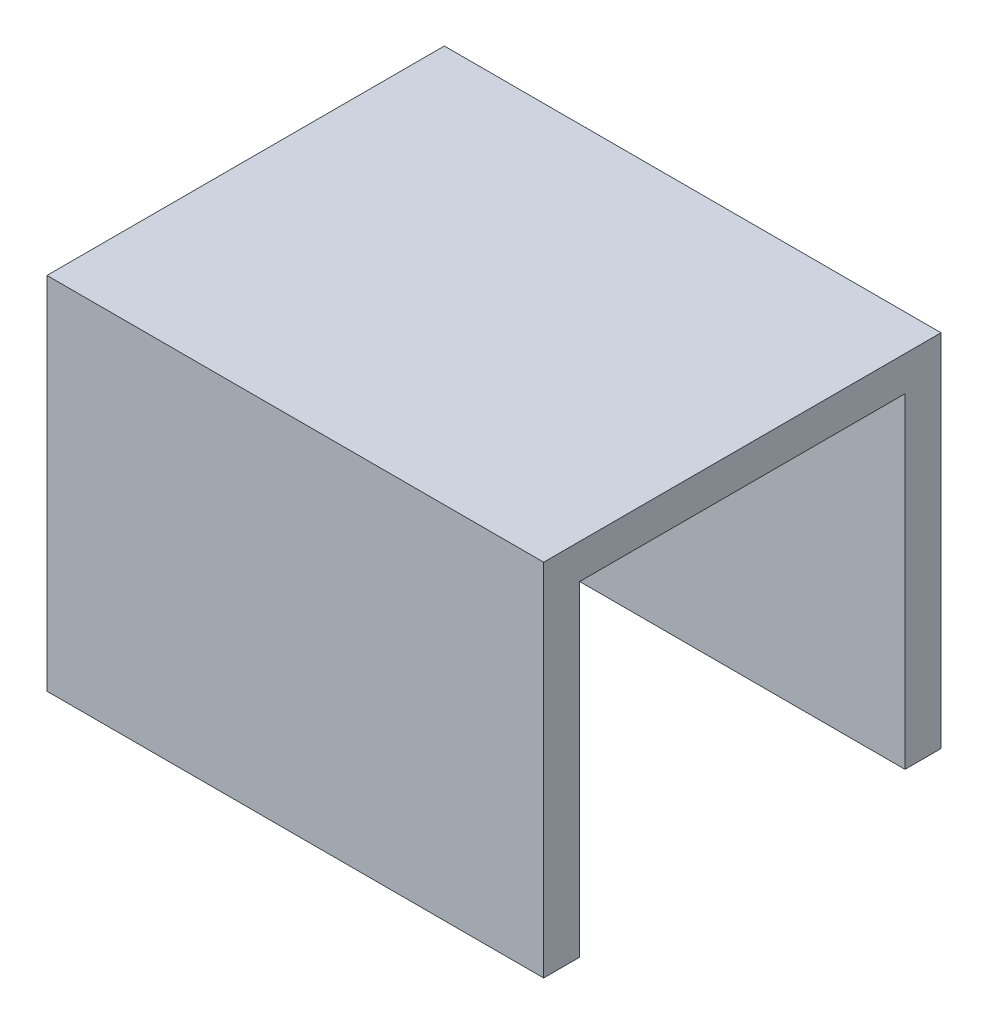
ISO-10303-21;
HEADER;
FILE_DESCRIPTION(('STEP AP214'),'2;1');
FILE_NAME('part.step','',(''),(''),'','','');
FILE_SCHEMA(('AUTOMOTIVE_DESIGN { 1 0 10303 214 1 1 1 1 }'));
ENDSEC;
DATA;
#1=APPLICATION_CONTEXT('core data for automotive mechanical design processes');
#2=APPLICATION_PROTOCOL_DEFINITION('international standard','automotive_design',2000,#1);
#3=PRODUCT_CONTEXT('',#1,'mechanical');
#4=PRODUCT('Part','Part','',(#3));
#5=PRODUCT_RELATED_PRODUCT_CATEGORY('part','',(#4));
#6=PRODUCT_DEFINITION_FORMATION('','',#4);
#7=PRODUCT_DEFINITION_CONTEXT('part definition',#1,'design');
#8=PRODUCT_DEFINITION('design','',#6,#7);
#9=PRODUCT_DEFINITION_SHAPE('','',#8);
#10=(LENGTH_UNIT() NAMED_UNIT(*) SI_UNIT(.MILLI.,.METRE.));
#11=(NAMED_UNIT(*) PLANE_ANGLE_UNIT() SI_UNIT($,.RADIAN.));
#12=(NAMED_UNIT(*) SI_UNIT($,.STERADIAN.) SOLID_ANGLE_UNIT());
#13=UNCERTAINTY_MEASURE_WITH_UNIT(LENGTH_MEASURE(1.E-05),#10,'distance_accuracy_value','');
#14=(GEOMETRIC_REPRESENTATION_CONTEXT(3) GLOBAL_UNCERTAINTY_ASSIGNED_CONTEXT((#13)) GLOBAL_UNIT_ASSIGNED_CONTEXT((#10,
#11,#12)) REPRESENTATION_CONTEXT('',''));
#15=CARTESIAN_POINT('',(0.,0.,0.));
#16=DIRECTION('',(0.,0.,1.));
#17=DIRECTION('',(1.,0.,0.));
#18=AXIS2_PLACEMENT_3D('',#15,#16,#17);
#19=CARTESIAN_POINT('',(0.,0.,0.));
#20=DIRECTION('',(0.,1.,0.));
#21=DIRECTION('',(0.,0.,1.));
#22=AXIS2_PLACEMENT_3D('',#19,#20,#21);
#23=PLANE('',#22);
#24=DIRECTION('',(0.,0.,-1.));
#25=VECTOR('',#24,1.);
#26=CARTESIAN_POINT('',(10.,0.,8.));
#27=LINE('',#26,#25);
#28=CARTESIAN_POINT('',(10.,0.,-6.55));
#29=VERTEX_POINT('',#28);
#30=CARTESIAN_POINT('',(10.,0.,-8.));
#31=VERTEX_POINT('',#30);
#32=EDGE_CURVE('E124',#29,#31,#27,.T.);
#33=ORIENTED_EDGE('',*,*,#32,.F.);
#34=DIRECTION('',(-1.,0.,0.));
#35=VECTOR('',#34,1.);
#36=CARTESIAN_POINT('',(10.001,0.,-6.55));
#37=LINE('',#36,#35);
#38=CARTESIAN_POINT('',(-10.,0.,-6.55));
#39=VERTEX_POINT('',#38);
#40=EDGE_CURVE('E107',#29,#39,#37,.T.);
#41=ORIENTED_EDGE('',*,*,#40,.T.);
#42=DIRECTION('',(0.,0.,1.));
#43=VECTOR('',#42,1.);
#44=CARTESIAN_POINT('',(-10.,0.,8.));
#45=LINE('',#44,#43);
#46=CARTESIAN_POINT('',(-10.,0.,-8.));
#47=VERTEX_POINT('',#46);
#48=EDGE_CURVE('E132',#47,#39,#45,.T.);
#49=ORIENTED_EDGE('',*,*,#48,.F.);
#50=DIRECTION('',(-1.,0.,0.));
#51=VECTOR('',#50,1.);
#52=CARTESIAN_POINT('',(10.,0.,-8.));
#53=LINE('',#52,#51);
#54=EDGE_CURVE('E78',#31,#47,#53,.T.);
#55=ORIENTED_EDGE('',*,*,#54,.F.);
#56=EDGE_LOOP('',(#33,#41,#49,#55));
#57=FACE_BOUND('',#56,.T.);
#58=ADVANCED_FACE('F33',(#57),#23,.F.);
#59=CARTESIAN_POINT('',(-10.,14.5,8.));
#60=DIRECTION('',(1.,0.,0.));
#61=DIRECTION('',(0.,0.,-1.));
#62=AXIS2_PLACEMENT_3D('',#59,#60,#61);
#63=PLANE('',#62);
#64=ORIENTED_EDGE('',*,*,#48,.T.);
#65=DIRECTION('',(0.,-1.,0.));
#66=VECTOR('',#65,1.);
#67=CARTESIAN_POINT('',(-10.,0.,-6.55));
#68=LINE('',#67,#66);
#69=CARTESIAN_POINT('',(-10.,13.1,-6.55));
#70=VERTEX_POINT('',#69);
#71=EDGE_CURVE('E113',#70,#39,#68,.T.);
#72=ORIENTED_EDGE('',*,*,#71,.F.);
#73=DIRECTION('',(0.,0.,-1.));
#74=VECTOR('',#73,1.);
#75=CARTESIAN_POINT('',(-10.,13.1,-6.55));
#76=LINE('',#75,#74);
#77=CARTESIAN_POINT('',(-10.,13.1,6.55));
#78=VERTEX_POINT('',#77);
#79=EDGE_CURVE('E119',#78,#70,#76,.T.);
#80=ORIENTED_EDGE('',*,*,#79,.F.);
#81=DIRECTION('',(0.,1.,0.));
#82=VECTOR('',#81,1.);
#83=CARTESIAN_POINT('',(-10.,0.,6.55));
#84=LINE('',#83,#82);
#85=CARTESIAN_POINT('',(-10.,0.,6.55));
#86=VERTEX_POINT('',#85);
#87=EDGE_CURVE('E166',#86,#78,#84,.T.);
#88=ORIENTED_EDGE('',*,*,#87,.F.);
#89=CARTESIAN_POINT('',(-10.,0.,8.));
#90=VERTEX_POINT('',#89);
#91=EDGE_CURVE('E149',#86,#90,#45,.T.);
#92=ORIENTED_EDGE('',*,*,#91,.T.);
#93=DIRECTION('',(0.,-1.,0.));
#94=VECTOR('',#93,1.);
#95=CARTESIAN_POINT('',(-10.,14.5,8.));
#96=LINE('',#95,#94);
#97=CARTESIAN_POINT('',(-10.,14.5,8.));
#98=VERTEX_POINT('',#97);
#99=EDGE_CURVE('E11',#98,#90,#96,.T.);
#100=ORIENTED_EDGE('',*,*,#99,.F.);
#101=DIRECTION('',(0.,0.,1.));
#102=VECTOR('',#101,1.);
#103=CARTESIAN_POINT('',(-10.,14.5,8.));
#104=LINE('',#103,#102);
#105=CARTESIAN_POINT('',(-10.,14.5,-8.));
#106=VERTEX_POINT('',#105);
#107=EDGE_CURVE('E137',#106,#98,#104,.T.);
#108=ORIENTED_EDGE('',*,*,#107,.F.);
#109=DIRECTION('',(0.,-1.,0.));
#110=VECTOR('',#109,1.);
#111=CARTESIAN_POINT('',(-10.,14.5,-8.));
#112=LINE('',#111,#110);
#113=EDGE_CURVE('E138',#106,#47,#112,.T.);
#114=ORIENTED_EDGE('',*,*,#113,.T.);
#115=EDGE_LOOP('',(#64,#72,#80,#88,#92,#100,#108,#114));
#116=FACE_BOUND('',#115,.T.);
#117=ADVANCED_FACE('F35',(#116),#63,.F.);
#118=CARTESIAN_POINT('',(10.,14.5,8.));
#119=DIRECTION('',(0.,0.,-1.));
#120=DIRECTION('',(-1.,0.,0.));
#121=AXIS2_PLACEMENT_3D('',#118,#119,#120);
#122=PLANE('',#121);
#123=DIRECTION('',(1.,0.,0.));
#124=VECTOR('',#123,1.);
#125=CARTESIAN_POINT('',(10.,0.,8.));
#126=LINE('',#125,#124);
#127=CARTESIAN_POINT('',(10.,0.,8.));
#128=VERTEX_POINT('',#127);
#129=EDGE_CURVE('E129',#90,#128,#126,.T.);
#130=ORIENTED_EDGE('',*,*,#129,.T.);
#131=DIRECTION('',(0.,-1.,0.));
#132=VECTOR('',#131,1.);
#133=CARTESIAN_POINT('',(10.,14.5,8.));
#134=LINE('',#133,#132);
#135=CARTESIAN_POINT('',(10.,14.5,8.));
#136=VERTEX_POINT('',#135);
#137=EDGE_CURVE('E41',#136,#128,#134,.T.);
#138=ORIENTED_EDGE('',*,*,#137,.F.);
#139=DIRECTION('',(1.,0.,0.));
#140=VECTOR('',#139,1.);
#141=CARTESIAN_POINT('',(10.,14.5,8.));
#142=LINE('',#141,#140);
#143=EDGE_CURVE('E85',#98,#136,#142,.T.);
#144=ORIENTED_EDGE('',*,*,#143,.F.);
#145=ORIENTED_EDGE('',*,*,#99,.T.);
#146=EDGE_LOOP('',(#130,#138,#144,#145));
#147=FACE_BOUND('',#146,.T.);
#148=ADVANCED_FACE('F174',(#147),#122,.F.);
#149=CARTESIAN_POINT('',(10.,14.5,8.));
#150=DIRECTION('',(-1.,0.,0.));
#151=DIRECTION('',(0.,0.,1.));
#152=AXIS2_PLACEMENT_3D('',#149,#150,#151);
#153=PLANE('',#152);
#154=DIRECTION('',(0.,0.,1.));
#155=VECTOR('',#154,1.);
#156=CARTESIAN_POINT('',(10.,13.1,-6.55));
#157=LINE('',#156,#155);
#158=CARTESIAN_POINT('',(10.,13.1,-6.55));
#159=VERTEX_POINT('',#158);
#160=CARTESIAN_POINT('',(10.,13.1,6.55));
#161=VERTEX_POINT('',#160);
#162=EDGE_CURVE('E126',#159,#161,#157,.T.);
#163=ORIENTED_EDGE('',*,*,#162,.F.);
#164=DIRECTION('',(0.,1.,0.));
#165=VECTOR('',#164,1.);
#166=CARTESIAN_POINT('',(10.,0.,-6.55));
#167=LINE('',#166,#165);
#168=EDGE_CURVE('E110',#29,#159,#167,.T.);
#169=ORIENTED_EDGE('',*,*,#168,.F.);
#170=ORIENTED_EDGE('',*,*,#32,.T.);
#171=DIRECTION('',(0.,-1.,0.));
#172=VECTOR('',#171,1.);
#173=CARTESIAN_POINT('',(10.,14.5,-8.));
#174=LINE('',#173,#172);
#175=CARTESIAN_POINT('',(10.,14.5,-8.));
#176=VERTEX_POINT('',#175);
#177=EDGE_CURVE('E140',#176,#31,#174,.T.);
#178=ORIENTED_EDGE('',*,*,#177,.F.);
#179=DIRECTION('',(0.,0.,-1.));
#180=VECTOR('',#179,1.);
#181=CARTESIAN_POINT('',(10.,14.5,8.));
#182=LINE('',#181,#180);
#183=EDGE_CURVE('E144',#136,#176,#182,.T.);
#184=ORIENTED_EDGE('',*,*,#183,.F.);
#185=ORIENTED_EDGE('',*,*,#137,.T.);
#186=CARTESIAN_POINT('',(10.,0.,6.55));
#187=VERTEX_POINT('',#186);
#188=EDGE_CURVE('E128',#128,#187,#27,.T.);
#189=ORIENTED_EDGE('',*,*,#188,.T.);
#190=DIRECTION('',(0.,-1.,0.));
#191=VECTOR('',#190,1.);
#192=CARTESIAN_POINT('',(10.,0.,6.55));
#193=LINE('',#192,#191);
#194=EDGE_CURVE('E48',#161,#187,#193,.T.);
#195=ORIENTED_EDGE('',*,*,#194,.F.);
#196=EDGE_LOOP('',(#163,#169,#170,#178,#184,#185,#189,#195));
#197=FACE_BOUND('',#196,.T.);
#198=ADVANCED_FACE('F122',(#197),#153,.F.);
#199=CARTESIAN_POINT('',(10.,14.5,-8.));
#200=DIRECTION('',(0.,0.,1.));
#201=DIRECTION('',(1.,0.,0.));
#202=AXIS2_PLACEMENT_3D('',#199,#200,#201);
#203=PLANE('',#202);
#204=ORIENTED_EDGE('',*,*,#54,.T.);
#205=ORIENTED_EDGE('',*,*,#113,.F.);
#206=DIRECTION('',(-1.,0.,0.));
#207=VECTOR('',#206,1.);
#208=CARTESIAN_POINT('',(10.,14.5,-8.));
#209=LINE('',#208,#207);
#210=EDGE_CURVE('E57',#176,#106,#209,.T.);
#211=ORIENTED_EDGE('',*,*,#210,.F.);
#212=ORIENTED_EDGE('',*,*,#177,.T.);
#213=EDGE_LOOP('',(#204,#205,#211,#212));
#214=FACE_BOUND('',#213,.T.);
#215=ADVANCED_FACE('F191',(#214),#203,.F.);
#216=CARTESIAN_POINT('',(0.,14.5,0.));
#217=DIRECTION('',(0.,1.,0.));
#218=DIRECTION('',(0.,0.,1.));
#219=AXIS2_PLACEMENT_3D('',#216,#217,#218);
#220=PLANE('',#219);
#221=ORIENTED_EDGE('',*,*,#107,.T.);
#222=ORIENTED_EDGE('',*,*,#143,.T.);
#223=ORIENTED_EDGE('',*,*,#183,.T.);
#224=ORIENTED_EDGE('',*,*,#210,.T.);
#225=EDGE_LOOP('',(#221,#222,#223,#224));
#226=FACE_BOUND('',#225,.T.);
#227=ADVANCED_FACE('F185',(#226),#220,.T.);
#228=ORIENTED_EDGE('',*,*,#91,.F.);
#229=DIRECTION('',(-1.,0.,0.));
#230=VECTOR('',#229,1.);
#231=CARTESIAN_POINT('',(10.001,0.,6.55));
#232=LINE('',#231,#230);
#233=EDGE_CURVE('E118',#187,#86,#232,.T.);
#234=ORIENTED_EDGE('',*,*,#233,.F.);
#235=ORIENTED_EDGE('',*,*,#188,.F.);
#236=ORIENTED_EDGE('',*,*,#129,.F.);
#237=EDGE_LOOP('',(#228,#234,#235,#236));
#238=FACE_BOUND('',#237,.T.);
#239=ADVANCED_FACE('F148',(#238),#23,.F.);
#240=CARTESIAN_POINT('',(10.001,0.,-6.55));
#241=DIRECTION('',(0.,0.,-1.));
#242=DIRECTION('',(-1.,0.,0.));
#243=AXIS2_PLACEMENT_3D('',#240,#241,#242);
#244=PLANE('',#243);
#245=ORIENTED_EDGE('',*,*,#168,.T.);
#246=DIRECTION('',(-1.,0.,0.));
#247=VECTOR('',#246,1.);
#248=CARTESIAN_POINT('',(10.001,13.1,-6.55));
#249=LINE('',#248,#247);
#250=EDGE_CURVE('E154',#159,#70,#249,.T.);
#251=ORIENTED_EDGE('',*,*,#250,.T.);
#252=ORIENTED_EDGE('',*,*,#71,.T.);
#253=ORIENTED_EDGE('',*,*,#40,.F.);
#254=EDGE_LOOP('',(#245,#251,#252,#253));
#255=FACE_BOUND('',#254,.T.);
#256=ADVANCED_FACE('F109',(#255),#244,.F.);
#257=CARTESIAN_POINT('',(10.001,13.1,-6.55));
#258=DIRECTION('',(0.,1.,0.));
#259=DIRECTION('',(0.,0.,1.));
#260=AXIS2_PLACEMENT_3D('',#257,#258,#259);
#261=PLANE('',#260);
#262=ORIENTED_EDGE('',*,*,#162,.T.);
#263=DIRECTION('',(-1.,0.,0.));
#264=VECTOR('',#263,1.);
#265=CARTESIAN_POINT('',(10.001,13.1,6.55));
#266=LINE('',#265,#264);
#267=EDGE_CURVE('E152',#161,#78,#266,.T.);
#268=ORIENTED_EDGE('',*,*,#267,.T.);
#269=ORIENTED_EDGE('',*,*,#79,.T.);
#270=ORIENTED_EDGE('',*,*,#250,.F.);
#271=EDGE_LOOP('',(#262,#268,#269,#270));
#272=FACE_BOUND('',#271,.T.);
#273=ADVANCED_FACE('F171',(#272),#261,.F.);
#274=CARTESIAN_POINT('',(10.001,0.,6.55));
#275=DIRECTION('',(0.,0.,1.));
#276=DIRECTION('',(1.,0.,0.));
#277=AXIS2_PLACEMENT_3D('',#274,#275,#276);
#278=PLANE('',#277);
#279=ORIENTED_EDGE('',*,*,#194,.T.);
#280=ORIENTED_EDGE('',*,*,#233,.T.);
#281=ORIENTED_EDGE('',*,*,#87,.T.);
#282=ORIENTED_EDGE('',*,*,#267,.F.);
#283=EDGE_LOOP('',(#279,#280,#281,#282));
#284=FACE_BOUND('',#283,.T.);
#285=ADVANCED_FACE('F196',(#284),#278,.F.);
#286=CLOSED_SHELL('',(#58,#117,#148,#198,#215,#227,#239,#256,#273,#285));
#287=MANIFOLD_SOLID_BREP('B2',#286);
#288=ADVANCED_BREP_SHAPE_REPRESENTATION('',(#18,#287),#14);
#289=SHAPE_DEFINITION_REPRESENTATION(#9,#288);
ENDSEC;
END-ISO-10303-21;
